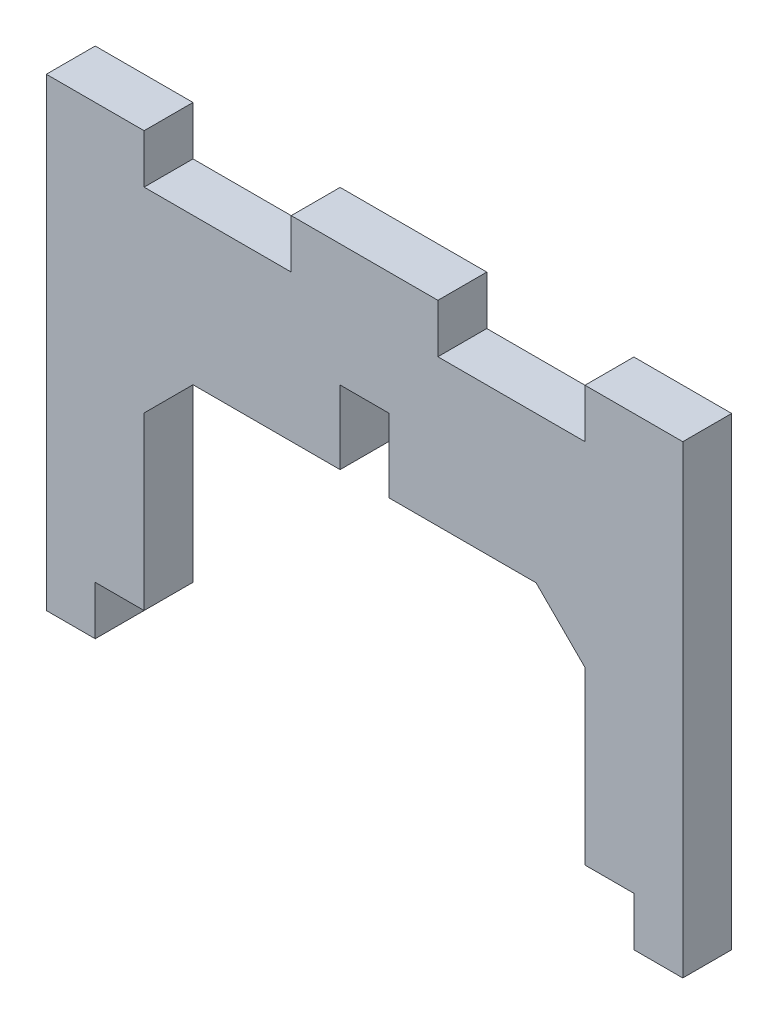
ISO-10303-21;
HEADER;
FILE_DESCRIPTION(('STEP AP214'),'2;1');
FILE_NAME('part.step','',(''),(''),'','','');
FILE_SCHEMA(('AUTOMOTIVE_DESIGN { 1 0 10303 214 1 1 1 1 }'));
ENDSEC;
DATA;
#1=APPLICATION_CONTEXT('core data for automotive mechanical design processes');
#2=APPLICATION_PROTOCOL_DEFINITION('international standard','automotive_design',2000,#1);
#3=PRODUCT_CONTEXT('',#1,'mechanical');
#4=PRODUCT('Part','Part','',(#3));
#5=PRODUCT_RELATED_PRODUCT_CATEGORY('part','',(#4));
#6=PRODUCT_DEFINITION_FORMATION('','',#4);
#7=PRODUCT_DEFINITION_CONTEXT('part definition',#1,'design');
#8=PRODUCT_DEFINITION('design','',#6,#7);
#9=PRODUCT_DEFINITION_SHAPE('','',#8);
#10=(LENGTH_UNIT() NAMED_UNIT(*) SI_UNIT(.MILLI.,.METRE.));
#11=(NAMED_UNIT(*) PLANE_ANGLE_UNIT() SI_UNIT($,.RADIAN.));
#12=(NAMED_UNIT(*) SI_UNIT($,.STERADIAN.) SOLID_ANGLE_UNIT());
#13=UNCERTAINTY_MEASURE_WITH_UNIT(LENGTH_MEASURE(1.E-05),#10,'distance_accuracy_value','');
#14=(GEOMETRIC_REPRESENTATION_CONTEXT(3) GLOBAL_UNCERTAINTY_ASSIGNED_CONTEXT((#13)) GLOBAL_UNIT_ASSIGNED_CONTEXT((#10,
#11,#12)) REPRESENTATION_CONTEXT('',''));
#15=CARTESIAN_POINT('',(0.,0.,0.));
#16=DIRECTION('',(0.,0.,1.));
#17=DIRECTION('',(1.,0.,0.));
#18=AXIS2_PLACEMENT_3D('',#15,#16,#17);
#19=CARTESIAN_POINT('',(0.,34.,4.));
#20=DIRECTION('',(0.,-1.,0.));
#21=DIRECTION('',(1.,0.,0.));
#22=AXIS2_PLACEMENT_3D('',#19,#20,#21);
#23=PLANE('',#22);
#24=DIRECTION('',(-1.,0.,0.));
#25=VECTOR('',#24,1.);
#26=CARTESIAN_POINT('',(0.,34.,0.));
#27=LINE('',#26,#25);
#28=CARTESIAN_POINT('',(44.07,34.,0.));
#29=VERTEX_POINT('',#28);
#30=CARTESIAN_POINT('',(32.035,34.,0.));
#31=VERTEX_POINT('',#30);
#32=EDGE_CURVE('E327',#29,#31,#27,.T.);
#33=ORIENTED_EDGE('',*,*,#32,.T.);
#34=DIRECTION('',(0.,0.,1.));
#35=VECTOR('',#34,1.);
#36=CARTESIAN_POINT('',(32.035,34.,-12.6491106406735));
#37=LINE('',#36,#35);
#38=CARTESIAN_POINT('',(32.035,34.,4.));
#39=VERTEX_POINT('',#38);
#40=EDGE_CURVE('E65',#31,#39,#37,.T.);
#41=ORIENTED_EDGE('',*,*,#40,.T.);
#42=DIRECTION('',(-1.,0.,0.));
#43=VECTOR('',#42,1.);
#44=CARTESIAN_POINT('',(0.,34.,4.));
#45=LINE('',#44,#43);
#46=CARTESIAN_POINT('',(44.07,34.,4.));
#47=VERTEX_POINT('',#46);
#48=EDGE_CURVE('E238',#47,#39,#45,.T.);
#49=ORIENTED_EDGE('',*,*,#48,.F.);
#50=DIRECTION('',(0.,0.,1.));
#51=VECTOR('',#50,1.);
#52=CARTESIAN_POINT('',(44.07,34.,-12.6491106406735));
#53=LINE('',#52,#51);
#54=EDGE_CURVE('E255',#29,#47,#53,.T.);
#55=ORIENTED_EDGE('',*,*,#54,.F.);
#56=EDGE_LOOP('',(#33,#41,#49,#55));
#57=FACE_BOUND('',#56,.T.);
#58=ADVANCED_FACE('F41',(#57),#23,.F.);
#59=CARTESIAN_POINT('',(20.035,34.,4.));
#60=VERTEX_POINT('',#59);
#61=CARTESIAN_POINT('',(8.,34.,4.));
#62=VERTEX_POINT('',#61);
#63=EDGE_CURVE('E57',#60,#62,#45,.T.);
#64=ORIENTED_EDGE('',*,*,#63,.F.);
#65=DIRECTION('',(0.,0.,1.));
#66=VECTOR('',#65,1.);
#67=CARTESIAN_POINT('',(20.035,34.,-12.6491106406735));
#68=LINE('',#67,#66);
#69=CARTESIAN_POINT('',(20.035,34.,0.));
#70=VERTEX_POINT('',#69);
#71=EDGE_CURVE('E246',#70,#60,#68,.T.);
#72=ORIENTED_EDGE('',*,*,#71,.F.);
#73=CARTESIAN_POINT('',(8.,34.,0.));
#74=VERTEX_POINT('',#73);
#75=EDGE_CURVE('E287',#70,#74,#27,.T.);
#76=ORIENTED_EDGE('',*,*,#75,.T.);
#77=DIRECTION('',(0.,0.,1.));
#78=VECTOR('',#77,1.);
#79=CARTESIAN_POINT('',(8.,34.,-12.6491106406735));
#80=LINE('',#79,#78);
#81=EDGE_CURVE('E279',#74,#62,#80,.T.);
#82=ORIENTED_EDGE('',*,*,#81,.T.);
#83=EDGE_LOOP('',(#64,#72,#76,#82));
#84=FACE_BOUND('',#83,.T.);
#85=ADVANCED_FACE('F490',(#84),#23,.F.);
#86=CARTESIAN_POINT('',(0.,0.,4.));
#87=DIRECTION('',(1.,0.,0.));
#88=DIRECTION('',(0.,1.,0.));
#89=AXIS2_PLACEMENT_3D('',#86,#87,#88);
#90=PLANE('',#89);
#91=DIRECTION('',(0.,-1.,0.));
#92=VECTOR('',#91,1.);
#93=CARTESIAN_POINT('',(0.,0.,0.));
#94=LINE('',#93,#92);
#95=CARTESIAN_POINT('',(0.,38.,0.));
#96=VERTEX_POINT('',#95);
#97=CARTESIAN_POINT('',(0.,0.,0.));
#98=VERTEX_POINT('',#97);
#99=EDGE_CURVE('E329',#96,#98,#94,.T.);
#100=ORIENTED_EDGE('',*,*,#99,.T.);
#101=DIRECTION('',(0.,0.,-1.));
#102=VECTOR('',#101,1.);
#103=CARTESIAN_POINT('',(0.,0.,4.));
#104=LINE('',#103,#102);
#105=CARTESIAN_POINT('',(0.,0.,4.));
#106=VERTEX_POINT('',#105);
#107=EDGE_CURVE('E394',#106,#98,#104,.T.);
#108=ORIENTED_EDGE('',*,*,#107,.F.);
#109=DIRECTION('',(0.,-1.,0.));
#110=VECTOR('',#109,1.);
#111=CARTESIAN_POINT('',(0.,0.,4.));
#112=LINE('',#111,#110);
#113=CARTESIAN_POINT('',(0.,38.,4.));
#114=VERTEX_POINT('',#113);
#115=EDGE_CURVE('E289',#114,#106,#112,.T.);
#116=ORIENTED_EDGE('',*,*,#115,.F.);
#117=DIRECTION('',(0.,0.,1.));
#118=VECTOR('',#117,1.);
#119=CARTESIAN_POINT('',(0.,38.,-12.6491106406735));
#120=LINE('',#119,#118);
#121=EDGE_CURVE('E273',#96,#114,#120,.T.);
#122=ORIENTED_EDGE('',*,*,#121,.F.);
#123=EDGE_LOOP('',(#100,#108,#116,#122));
#124=FACE_BOUND('',#123,.T.);
#125=ADVANCED_FACE('F500',(#124),#90,.F.);
#126=CARTESIAN_POINT('',(0.,0.,4.));
#127=DIRECTION('',(0.,1.,0.));
#128=DIRECTION('',(0.,0.,1.));
#129=AXIS2_PLACEMENT_3D('',#126,#127,#128);
#130=PLANE('',#129);
#131=DIRECTION('',(1.,0.,0.));
#132=VECTOR('',#131,1.);
#133=CARTESIAN_POINT('',(0.,0.,0.));
#134=LINE('',#133,#132);
#135=CARTESIAN_POINT('',(4.,0.,0.));
#136=VERTEX_POINT('',#135);
#137=EDGE_CURVE('E331',#98,#136,#134,.T.);
#138=ORIENTED_EDGE('',*,*,#137,.T.);
#139=DIRECTION('',(0.,0.,-1.));
#140=VECTOR('',#139,1.);
#141=CARTESIAN_POINT('',(4.,0.,4.));
#142=LINE('',#141,#140);
#143=CARTESIAN_POINT('',(4.,0.,4.));
#144=VERTEX_POINT('',#143);
#145=EDGE_CURVE('E391',#144,#136,#142,.T.);
#146=ORIENTED_EDGE('',*,*,#145,.F.);
#147=DIRECTION('',(1.,0.,0.));
#148=VECTOR('',#147,1.);
#149=CARTESIAN_POINT('',(0.,0.,4.));
#150=LINE('',#149,#148);
#151=EDGE_CURVE('E291',#106,#144,#150,.T.);
#152=ORIENTED_EDGE('',*,*,#151,.F.);
#153=ORIENTED_EDGE('',*,*,#107,.T.);
#154=EDGE_LOOP('',(#138,#146,#152,#153));
#155=FACE_BOUND('',#154,.T.);
#156=ADVANCED_FACE('F502',(#155),#130,.F.);
#157=CARTESIAN_POINT('',(4.,0.,4.));
#158=DIRECTION('',(-1.,0.,0.));
#159=DIRECTION('',(0.,0.,1.));
#160=AXIS2_PLACEMENT_3D('',#157,#158,#159);
#161=PLANE('',#160);
#162=DIRECTION('',(0.,1.,0.));
#163=VECTOR('',#162,1.);
#164=CARTESIAN_POINT('',(4.,0.,0.));
#165=LINE('',#164,#163);
#166=CARTESIAN_POINT('',(4.,4.,0.));
#167=VERTEX_POINT('',#166);
#168=EDGE_CURVE('E333',#136,#167,#165,.T.);
#169=ORIENTED_EDGE('',*,*,#168,.T.);
#170=DIRECTION('',(0.,0.,-1.));
#171=VECTOR('',#170,1.);
#172=CARTESIAN_POINT('',(4.,4.,4.));
#173=LINE('',#172,#171);
#174=CARTESIAN_POINT('',(4.,4.,4.));
#175=VERTEX_POINT('',#174);
#176=EDGE_CURVE('E388',#175,#167,#173,.T.);
#177=ORIENTED_EDGE('',*,*,#176,.F.);
#178=DIRECTION('',(0.,1.,0.));
#179=VECTOR('',#178,1.);
#180=CARTESIAN_POINT('',(4.,0.,4.));
#181=LINE('',#180,#179);
#182=EDGE_CURVE('E293',#144,#175,#181,.T.);
#183=ORIENTED_EDGE('',*,*,#182,.F.);
#184=ORIENTED_EDGE('',*,*,#145,.T.);
#185=EDGE_LOOP('',(#169,#177,#183,#184));
#186=FACE_BOUND('',#185,.T.);
#187=ADVANCED_FACE('F507',(#186),#161,.F.);
#188=CARTESIAN_POINT('',(0.,4.,4.));
#189=DIRECTION('',(0.,1.,0.));
#190=DIRECTION('',(0.,0.,1.));
#191=AXIS2_PLACEMENT_3D('',#188,#189,#190);
#192=PLANE('',#191);
#193=DIRECTION('',(1.,0.,0.));
#194=VECTOR('',#193,1.);
#195=CARTESIAN_POINT('',(0.,4.,0.));
#196=LINE('',#195,#194);
#197=CARTESIAN_POINT('',(8.,4.,0.));
#198=VERTEX_POINT('',#197);
#199=EDGE_CURVE('E335',#167,#198,#196,.T.);
#200=ORIENTED_EDGE('',*,*,#199,.T.);
#201=DIRECTION('',(0.,0.,-1.));
#202=VECTOR('',#201,1.);
#203=CARTESIAN_POINT('',(8.,4.,4.));
#204=LINE('',#203,#202);
#205=CARTESIAN_POINT('',(8.,4.,4.));
#206=VERTEX_POINT('',#205);
#207=EDGE_CURVE('E385',#206,#198,#204,.T.);
#208=ORIENTED_EDGE('',*,*,#207,.F.);
#209=DIRECTION('',(1.,0.,0.));
#210=VECTOR('',#209,1.);
#211=CARTESIAN_POINT('',(0.,4.,4.));
#212=LINE('',#211,#210);
#213=EDGE_CURVE('E295',#175,#206,#212,.T.);
#214=ORIENTED_EDGE('',*,*,#213,.F.);
#215=ORIENTED_EDGE('',*,*,#176,.T.);
#216=EDGE_LOOP('',(#200,#208,#214,#215));
#217=FACE_BOUND('',#216,.T.);
#218=ADVANCED_FACE('F510',(#217),#192,.F.);
#219=CARTESIAN_POINT('',(8.,0.,4.));
#220=DIRECTION('',(-1.,0.,0.));
#221=DIRECTION('',(0.,0.,1.));
#222=AXIS2_PLACEMENT_3D('',#219,#220,#221);
#223=PLANE('',#222);
#224=DIRECTION('',(0.,1.,0.));
#225=VECTOR('',#224,1.);
#226=CARTESIAN_POINT('',(8.,0.,0.));
#227=LINE('',#226,#225);
#228=CARTESIAN_POINT('',(8.,18.,0.));
#229=VERTEX_POINT('',#228);
#230=EDGE_CURVE('E337',#198,#229,#227,.T.);
#231=ORIENTED_EDGE('',*,*,#230,.T.);
#232=DIRECTION('',(0.,0.,1.));
#233=VECTOR('',#232,1.);
#234=CARTESIAN_POINT('',(8.,18.,4.));
#235=LINE('',#234,#233);
#236=CARTESIAN_POINT('',(8.,18.,4.));
#237=VERTEX_POINT('',#236);
#238=EDGE_CURVE('E405',#229,#237,#235,.T.);
#239=ORIENTED_EDGE('',*,*,#238,.T.);
#240=DIRECTION('',(0.,1.,0.));
#241=VECTOR('',#240,1.);
#242=CARTESIAN_POINT('',(8.,0.,4.));
#243=LINE('',#242,#241);
#244=EDGE_CURVE('E297',#206,#237,#243,.T.);
#245=ORIENTED_EDGE('',*,*,#244,.F.);
#246=ORIENTED_EDGE('',*,*,#207,.T.);
#247=EDGE_LOOP('',(#231,#239,#245,#246));
#248=FACE_BOUND('',#247,.T.);
#249=ADVANCED_FACE('F420',(#248),#223,.F.);
#250=CARTESIAN_POINT('',(0.,22.,4.));
#251=DIRECTION('',(0.,1.,0.));
#252=DIRECTION('',(0.,0.,1.));
#253=AXIS2_PLACEMENT_3D('',#250,#251,#252);
#254=PLANE('',#253);
#255=DIRECTION('',(1.,0.,0.));
#256=VECTOR('',#255,1.);
#257=CARTESIAN_POINT('',(0.,22.,4.));
#258=LINE('',#257,#256);
#259=CARTESIAN_POINT('',(12.,22.,4.));
#260=VERTEX_POINT('',#259);
#261=CARTESIAN_POINT('',(24.035,22.,4.));
#262=VERTEX_POINT('',#261);
#263=EDGE_CURVE('E300',#260,#262,#258,.T.);
#264=ORIENTED_EDGE('',*,*,#263,.F.);
#265=DIRECTION('',(0.,0.,-1.));
#266=VECTOR('',#265,1.);
#267=CARTESIAN_POINT('',(12.,22.,0.));
#268=LINE('',#267,#266);
#269=CARTESIAN_POINT('',(12.,22.,0.));
#270=VERTEX_POINT('',#269);
#271=EDGE_CURVE('E402',#260,#270,#268,.T.);
#272=ORIENTED_EDGE('',*,*,#271,.T.);
#273=DIRECTION('',(1.,0.,0.));
#274=VECTOR('',#273,1.);
#275=CARTESIAN_POINT('',(0.,22.,0.));
#276=LINE('',#275,#274);
#277=CARTESIAN_POINT('',(24.035,22.,0.));
#278=VERTEX_POINT('',#277);
#279=EDGE_CURVE('E340',#270,#278,#276,.T.);
#280=ORIENTED_EDGE('',*,*,#279,.T.);
#281=DIRECTION('',(0.,0.,-1.));
#282=VECTOR('',#281,1.);
#283=CARTESIAN_POINT('',(24.035,22.,4.));
#284=LINE('',#283,#282);
#285=EDGE_CURVE('E382',#262,#278,#284,.T.);
#286=ORIENTED_EDGE('',*,*,#285,.F.);
#287=EDGE_LOOP('',(#264,#272,#280,#286));
#288=FACE_BOUND('',#287,.T.);
#289=ADVANCED_FACE('F427',(#288),#254,.F.);
#290=CARTESIAN_POINT('',(24.035,0.,4.));
#291=DIRECTION('',(-1.,0.,0.));
#292=DIRECTION('',(0.,-1.,0.));
#293=AXIS2_PLACEMENT_3D('',#290,#291,#292);
#294=PLANE('',#293);
#295=DIRECTION('',(0.,1.,0.));
#296=VECTOR('',#295,1.);
#297=CARTESIAN_POINT('',(24.035,0.,0.));
#298=LINE('',#297,#296);
#299=CARTESIAN_POINT('',(24.035,28.,0.));
#300=VERTEX_POINT('',#299);
#301=EDGE_CURVE('E342',#278,#300,#298,.T.);
#302=ORIENTED_EDGE('',*,*,#301,.T.);
#303=DIRECTION('',(0.,0.,-1.));
#304=VECTOR('',#303,1.);
#305=CARTESIAN_POINT('',(24.035,28.,4.));
#306=LINE('',#305,#304);
#307=CARTESIAN_POINT('',(24.035,28.,4.));
#308=VERTEX_POINT('',#307);
#309=EDGE_CURVE('E379',#308,#300,#306,.T.);
#310=ORIENTED_EDGE('',*,*,#309,.F.);
#311=DIRECTION('',(0.,1.,0.));
#312=VECTOR('',#311,1.);
#313=CARTESIAN_POINT('',(24.035,0.,4.));
#314=LINE('',#313,#312);
#315=EDGE_CURVE('E302',#262,#308,#314,.T.);
#316=ORIENTED_EDGE('',*,*,#315,.F.);
#317=ORIENTED_EDGE('',*,*,#285,.T.);
#318=EDGE_LOOP('',(#302,#310,#316,#317));
#319=FACE_BOUND('',#318,.T.);
#320=ADVANCED_FACE('F431',(#319),#294,.F.);
#321=CARTESIAN_POINT('',(0.,28.,4.));
#322=DIRECTION('',(0.,1.,0.));
#323=DIRECTION('',(0.,0.,1.));
#324=AXIS2_PLACEMENT_3D('',#321,#322,#323);
#325=PLANE('',#324);
#326=DIRECTION('',(1.,0.,0.));
#327=VECTOR('',#326,1.);
#328=CARTESIAN_POINT('',(0.,28.,0.));
#329=LINE('',#328,#327);
#330=CARTESIAN_POINT('',(28.035,28.,0.));
#331=VERTEX_POINT('',#330);
#332=EDGE_CURVE('E344',#300,#331,#329,.T.);
#333=ORIENTED_EDGE('',*,*,#332,.T.);
#334=DIRECTION('',(0.,0.,-1.));
#335=VECTOR('',#334,1.);
#336=CARTESIAN_POINT('',(28.035,28.,4.));
#337=LINE('',#336,#335);
#338=CARTESIAN_POINT('',(28.035,28.,4.));
#339=VERTEX_POINT('',#338);
#340=EDGE_CURVE('E377',#339,#331,#337,.T.);
#341=ORIENTED_EDGE('',*,*,#340,.F.);
#342=DIRECTION('',(1.,0.,0.));
#343=VECTOR('',#342,1.);
#344=CARTESIAN_POINT('',(0.,28.,4.));
#345=LINE('',#344,#343);
#346=EDGE_CURVE('E304',#308,#339,#345,.T.);
#347=ORIENTED_EDGE('',*,*,#346,.F.);
#348=ORIENTED_EDGE('',*,*,#309,.T.);
#349=EDGE_LOOP('',(#333,#341,#347,#348));
#350=FACE_BOUND('',#349,.T.);
#351=ADVANCED_FACE('F437',(#350),#325,.F.);
#352=CARTESIAN_POINT('',(28.035,0.,4.));
#353=DIRECTION('',(-1.,0.,0.));
#354=DIRECTION('',(0.,-1.,0.));
#355=AXIS2_PLACEMENT_3D('',#352,#353,#354);
#356=PLANE('',#355);
#357=DIRECTION('',(0.,1.,0.));
#358=VECTOR('',#357,1.);
#359=CARTESIAN_POINT('',(28.035,0.,0.));
#360=LINE('',#359,#358);
#361=CARTESIAN_POINT('',(28.035,22.,0.));
#362=VERTEX_POINT('',#361);
#363=EDGE_CURVE('E347',#362,#331,#360,.T.);
#364=ORIENTED_EDGE('',*,*,#363,.F.);
#365=DIRECTION('',(0.,0.,-1.));
#366=VECTOR('',#365,1.);
#367=CARTESIAN_POINT('',(28.035,22.,4.));
#368=LINE('',#367,#366);
#369=CARTESIAN_POINT('',(28.035,22.,4.));
#370=VERTEX_POINT('',#369);
#371=EDGE_CURVE('E374',#370,#362,#368,.T.);
#372=ORIENTED_EDGE('',*,*,#371,.F.);
#373=DIRECTION('',(0.,1.,0.));
#374=VECTOR('',#373,1.);
#375=CARTESIAN_POINT('',(28.035,0.,4.));
#376=LINE('',#375,#374);
#377=EDGE_CURVE('E306',#370,#339,#376,.T.);
#378=ORIENTED_EDGE('',*,*,#377,.T.);
#379=ORIENTED_EDGE('',*,*,#340,.T.);
#380=EDGE_LOOP('',(#364,#372,#378,#379));
#381=FACE_BOUND('',#380,.T.);
#382=ADVANCED_FACE('F442',(#381),#356,.T.);
#383=CARTESIAN_POINT('',(0.,22.,4.));
#384=DIRECTION('',(0.,-1.,0.));
#385=DIRECTION('',(0.,0.,-1.));
#386=AXIS2_PLACEMENT_3D('',#383,#384,#385);
#387=PLANE('',#386);
#388=DIRECTION('',(-1.,0.,0.));
#389=VECTOR('',#388,1.);
#390=CARTESIAN_POINT('',(0.,22.,0.));
#391=LINE('',#390,#389);
#392=CARTESIAN_POINT('',(40.07,22.,0.));
#393=VERTEX_POINT('',#392);
#394=EDGE_CURVE('E350',#393,#362,#391,.T.);
#395=ORIENTED_EDGE('',*,*,#394,.F.);
#396=DIRECTION('',(0.,0.,1.));
#397=VECTOR('',#396,1.);
#398=CARTESIAN_POINT('',(40.07,22.,4.));
#399=LINE('',#398,#397);
#400=CARTESIAN_POINT('',(40.07,22.,4.));
#401=VERTEX_POINT('',#400);
#402=EDGE_CURVE('E400',#393,#401,#399,.T.);
#403=ORIENTED_EDGE('',*,*,#402,.T.);
#404=DIRECTION('',(-1.,0.,0.));
#405=VECTOR('',#404,1.);
#406=CARTESIAN_POINT('',(0.,22.,4.));
#407=LINE('',#406,#405);
#408=EDGE_CURVE('E309',#401,#370,#407,.T.);
#409=ORIENTED_EDGE('',*,*,#408,.T.);
#410=ORIENTED_EDGE('',*,*,#371,.T.);
#411=EDGE_LOOP('',(#395,#403,#409,#410));
#412=FACE_BOUND('',#411,.T.);
#413=ADVANCED_FACE('F445',(#412),#387,.T.);
#414=CARTESIAN_POINT('',(44.07,0.,4.));
#415=DIRECTION('',(-1.,0.,0.));
#416=DIRECTION('',(0.,0.,1.));
#417=AXIS2_PLACEMENT_3D('',#414,#415,#416);
#418=PLANE('',#417);
#419=DIRECTION('',(0.,1.,0.));
#420=VECTOR('',#419,1.);
#421=CARTESIAN_POINT('',(44.07,0.,4.));
#422=LINE('',#421,#420);
#423=CARTESIAN_POINT('',(44.07,4.,4.));
#424=VERTEX_POINT('',#423);
#425=CARTESIAN_POINT('',(44.07,18.,4.));
#426=VERTEX_POINT('',#425);
#427=EDGE_CURVE('E311',#424,#426,#422,.T.);
#428=ORIENTED_EDGE('',*,*,#427,.T.);
#429=DIRECTION('',(0.,0.,-1.));
#430=VECTOR('',#429,1.);
#431=CARTESIAN_POINT('',(44.07,18.,0.));
#432=LINE('',#431,#430);
#433=CARTESIAN_POINT('',(44.07,18.,0.));
#434=VERTEX_POINT('',#433);
#435=EDGE_CURVE('E397',#426,#434,#432,.T.);
#436=ORIENTED_EDGE('',*,*,#435,.T.);
#437=DIRECTION('',(0.,1.,0.));
#438=VECTOR('',#437,1.);
#439=CARTESIAN_POINT('',(44.07,0.,0.));
#440=LINE('',#439,#438);
#441=CARTESIAN_POINT('',(44.07,4.,0.));
#442=VERTEX_POINT('',#441);
#443=EDGE_CURVE('E352',#442,#434,#440,.T.);
#444=ORIENTED_EDGE('',*,*,#443,.F.);
#445=DIRECTION('',(0.,0.,-1.));
#446=VECTOR('',#445,1.);
#447=CARTESIAN_POINT('',(44.07,4.,4.));
#448=LINE('',#447,#446);
#449=EDGE_CURVE('E372',#424,#442,#448,.T.);
#450=ORIENTED_EDGE('',*,*,#449,.F.);
#451=EDGE_LOOP('',(#428,#436,#444,#450));
#452=FACE_BOUND('',#451,.T.);
#453=ADVANCED_FACE('F454',(#452),#418,.T.);
#454=CARTESIAN_POINT('',(0.,4.,4.));
#455=DIRECTION('',(0.,-1.,0.));
#456=DIRECTION('',(0.,0.,-1.));
#457=AXIS2_PLACEMENT_3D('',#454,#455,#456);
#458=PLANE('',#457);
#459=DIRECTION('',(-1.,0.,0.));
#460=VECTOR('',#459,1.);
#461=CARTESIAN_POINT('',(0.,4.,0.));
#462=LINE('',#461,#460);
#463=CARTESIAN_POINT('',(48.07,4.,0.));
#464=VERTEX_POINT('',#463);
#465=EDGE_CURVE('E355',#464,#442,#462,.T.);
#466=ORIENTED_EDGE('',*,*,#465,.F.);
#467=DIRECTION('',(0.,0.,-1.));
#468=VECTOR('',#467,1.);
#469=CARTESIAN_POINT('',(48.07,4.,4.));
#470=LINE('',#469,#468);
#471=CARTESIAN_POINT('',(48.07,4.,4.));
#472=VERTEX_POINT('',#471);
#473=EDGE_CURVE('E370',#472,#464,#470,.T.);
#474=ORIENTED_EDGE('',*,*,#473,.F.);
#475=DIRECTION('',(-1.,0.,0.));
#476=VECTOR('',#475,1.);
#477=CARTESIAN_POINT('',(0.,4.,4.));
#478=LINE('',#477,#476);
#479=EDGE_CURVE('E314',#472,#424,#478,.T.);
#480=ORIENTED_EDGE('',*,*,#479,.T.);
#481=ORIENTED_EDGE('',*,*,#449,.T.);
#482=EDGE_LOOP('',(#466,#474,#480,#481));
#483=FACE_BOUND('',#482,.T.);
#484=ADVANCED_FACE('F458',(#483),#458,.T.);
#485=CARTESIAN_POINT('',(48.07,0.,4.));
#486=DIRECTION('',(-1.,0.,0.));
#487=DIRECTION('',(0.,0.,1.));
#488=AXIS2_PLACEMENT_3D('',#485,#486,#487);
#489=PLANE('',#488);
#490=DIRECTION('',(0.,1.,0.));
#491=VECTOR('',#490,1.);
#492=CARTESIAN_POINT('',(48.07,0.,0.));
#493=LINE('',#492,#491);
#494=CARTESIAN_POINT('',(48.07,0.,0.));
#495=VERTEX_POINT('',#494);
#496=EDGE_CURVE('E358',#495,#464,#493,.T.);
#497=ORIENTED_EDGE('',*,*,#496,.F.);
#498=DIRECTION('',(0.,0.,-1.));
#499=VECTOR('',#498,1.);
#500=CARTESIAN_POINT('',(48.07,0.,4.));
#501=LINE('',#500,#499);
#502=CARTESIAN_POINT('',(48.07,0.,4.));
#503=VERTEX_POINT('',#502);
#504=EDGE_CURVE('E368',#503,#495,#501,.T.);
#505=ORIENTED_EDGE('',*,*,#504,.F.);
#506=DIRECTION('',(0.,1.,0.));
#507=VECTOR('',#506,1.);
#508=CARTESIAN_POINT('',(48.07,0.,4.));
#509=LINE('',#508,#507);
#510=EDGE_CURVE('E317',#503,#472,#509,.T.);
#511=ORIENTED_EDGE('',*,*,#510,.T.);
#512=ORIENTED_EDGE('',*,*,#473,.T.);
#513=EDGE_LOOP('',(#497,#505,#511,#512));
#514=FACE_BOUND('',#513,.T.);
#515=ADVANCED_FACE('F463',(#514),#489,.T.);
#516=CARTESIAN_POINT('',(0.,0.,4.));
#517=DIRECTION('',(0.,-1.,0.));
#518=DIRECTION('',(0.,0.,-1.));
#519=AXIS2_PLACEMENT_3D('',#516,#517,#518);
#520=PLANE('',#519);
#521=DIRECTION('',(-1.,0.,0.));
#522=VECTOR('',#521,1.);
#523=CARTESIAN_POINT('',(0.,0.,0.));
#524=LINE('',#523,#522);
#525=CARTESIAN_POINT('',(52.07,0.,0.));
#526=VERTEX_POINT('',#525);
#527=EDGE_CURVE('E361',#526,#495,#524,.T.);
#528=ORIENTED_EDGE('',*,*,#527,.F.);
#529=DIRECTION('',(0.,0.,-1.));
#530=VECTOR('',#529,1.);
#531=CARTESIAN_POINT('',(52.07,0.,4.));
#532=LINE('',#531,#530);
#533=CARTESIAN_POINT('',(52.07,0.,4.));
#534=VERTEX_POINT('',#533);
#535=EDGE_CURVE('E326',#534,#526,#532,.T.);
#536=ORIENTED_EDGE('',*,*,#535,.F.);
#537=DIRECTION('',(-1.,0.,0.));
#538=VECTOR('',#537,1.);
#539=CARTESIAN_POINT('',(0.,0.,4.));
#540=LINE('',#539,#538);
#541=EDGE_CURVE('E320',#534,#503,#540,.T.);
#542=ORIENTED_EDGE('',*,*,#541,.T.);
#543=ORIENTED_EDGE('',*,*,#504,.T.);
#544=EDGE_LOOP('',(#528,#536,#542,#543));
#545=FACE_BOUND('',#544,.T.);
#546=ADVANCED_FACE('F466',(#545),#520,.T.);
#547=CARTESIAN_POINT('',(52.07,0.,4.));
#548=DIRECTION('',(1.,0.,0.));
#549=DIRECTION('',(0.,0.,-1.));
#550=AXIS2_PLACEMENT_3D('',#547,#548,#549);
#551=PLANE('',#550);
#552=DIRECTION('',(0.,-1.,0.));
#553=VECTOR('',#552,1.);
#554=CARTESIAN_POINT('',(52.07,0.,0.));
#555=LINE('',#554,#553);
#556=CARTESIAN_POINT('',(52.07,38.,0.));
#557=VERTEX_POINT('',#556);
#558=EDGE_CURVE('E364',#557,#526,#555,.T.);
#559=ORIENTED_EDGE('',*,*,#558,.F.);
#560=DIRECTION('',(0.,0.,1.));
#561=VECTOR('',#560,1.);
#562=CARTESIAN_POINT('',(52.07,38.,-12.6491106406735));
#563=LINE('',#562,#561);
#564=CARTESIAN_POINT('',(52.07,38.,4.));
#565=VERTEX_POINT('',#564);
#566=EDGE_CURVE('E260',#557,#565,#563,.T.);
#567=ORIENTED_EDGE('',*,*,#566,.T.);
#568=DIRECTION('',(0.,-1.,0.));
#569=VECTOR('',#568,1.);
#570=CARTESIAN_POINT('',(52.07,0.,4.));
#571=LINE('',#570,#569);
#572=EDGE_CURVE('E323',#565,#534,#571,.T.);
#573=ORIENTED_EDGE('',*,*,#572,.T.);
#574=ORIENTED_EDGE('',*,*,#535,.T.);
#575=EDGE_LOOP('',(#559,#567,#573,#574));
#576=FACE_BOUND('',#575,.T.);
#577=ADVANCED_FACE('F468',(#576),#551,.T.);
#578=CARTESIAN_POINT('',(0.,0.,4.));
#579=DIRECTION('',(0.,0.,1.));
#580=DIRECTION('',(1.,0.,0.));
#581=AXIS2_PLACEMENT_3D('',#578,#579,#580);
#582=PLANE('',#581);
#583=ORIENTED_EDGE('',*,*,#572,.F.);
#584=DIRECTION('',(-1.,0.,0.));
#585=VECTOR('',#584,1.);
#586=CARTESIAN_POINT('',(52.07,38.,4.));
#587=LINE('',#586,#585);
#588=CARTESIAN_POINT('',(44.07,38.,4.));
#589=VERTEX_POINT('',#588);
#590=EDGE_CURVE('E251',#565,#589,#587,.T.);
#591=ORIENTED_EDGE('',*,*,#590,.T.);
#592=DIRECTION('',(0.,-1.,0.));
#593=VECTOR('',#592,1.);
#594=CARTESIAN_POINT('',(44.07,34.,4.));
#595=LINE('',#594,#593);
#596=EDGE_CURVE('E258',#589,#47,#595,.T.);
#597=ORIENTED_EDGE('',*,*,#596,.T.);
#598=ORIENTED_EDGE('',*,*,#48,.T.);
#599=DIRECTION('',(0.,1.,0.));
#600=VECTOR('',#599,1.);
#601=CARTESIAN_POINT('',(32.035,34.,4.));
#602=LINE('',#601,#600);
#603=CARTESIAN_POINT('',(32.035,38.,4.));
#604=VERTEX_POINT('',#603);
#605=EDGE_CURVE('E220',#39,#604,#602,.T.);
#606=ORIENTED_EDGE('',*,*,#605,.T.);
#607=DIRECTION('',(-1.,0.,0.));
#608=VECTOR('',#607,1.);
#609=CARTESIAN_POINT('',(32.035,38.,4.));
#610=LINE('',#609,#608);
#611=CARTESIAN_POINT('',(20.035,38.,4.));
#612=VERTEX_POINT('',#611);
#613=EDGE_CURVE('E229',#604,#612,#610,.T.);
#614=ORIENTED_EDGE('',*,*,#613,.T.);
#615=DIRECTION('',(0.,-1.,0.));
#616=VECTOR('',#615,1.);
#617=CARTESIAN_POINT('',(20.035,34.,4.));
#618=LINE('',#617,#616);
#619=EDGE_CURVE('E226',#612,#60,#618,.T.);
#620=ORIENTED_EDGE('',*,*,#619,.T.);
#621=ORIENTED_EDGE('',*,*,#63,.T.);
#622=DIRECTION('',(0.,1.,0.));
#623=VECTOR('',#622,1.);
#624=CARTESIAN_POINT('',(8.,38.,4.));
#625=LINE('',#624,#623);
#626=CARTESIAN_POINT('',(8.,38.,4.));
#627=VERTEX_POINT('',#626);
#628=EDGE_CURVE('E269',#62,#627,#625,.T.);
#629=ORIENTED_EDGE('',*,*,#628,.T.);
#630=DIRECTION('',(-1.,0.,0.));
#631=VECTOR('',#630,1.);
#632=CARTESIAN_POINT('',(0.,38.,4.));
#633=LINE('',#632,#631);
#634=EDGE_CURVE('E276',#627,#114,#633,.T.);
#635=ORIENTED_EDGE('',*,*,#634,.T.);
#636=ORIENTED_EDGE('',*,*,#115,.T.);
#637=ORIENTED_EDGE('',*,*,#151,.T.);
#638=ORIENTED_EDGE('',*,*,#182,.T.);
#639=ORIENTED_EDGE('',*,*,#213,.T.);
#640=ORIENTED_EDGE('',*,*,#244,.T.);
#641=DIRECTION('',(-0.707106781186551,-0.707106781186544,0.));
#642=VECTOR('',#641,1.);
#643=CARTESIAN_POINT('',(12.,22.,4.));
#644=LINE('',#643,#642);
#645=EDGE_CURVE('E11',#237,#260,#644,.F.);
#646=ORIENTED_EDGE('',*,*,#645,.T.);
#647=ORIENTED_EDGE('',*,*,#263,.T.);
#648=ORIENTED_EDGE('',*,*,#315,.T.);
#649=ORIENTED_EDGE('',*,*,#346,.T.);
#650=ORIENTED_EDGE('',*,*,#377,.F.);
#651=ORIENTED_EDGE('',*,*,#408,.F.);
#652=DIRECTION('',(-0.707106781186544,0.707106781186551,0.));
#653=VECTOR('',#652,1.);
#654=CARTESIAN_POINT('',(44.07,18.,4.));
#655=LINE('',#654,#653);
#656=EDGE_CURVE('E409',#401,#426,#655,.F.);
#657=ORIENTED_EDGE('',*,*,#656,.T.);
#658=ORIENTED_EDGE('',*,*,#427,.F.);
#659=ORIENTED_EDGE('',*,*,#479,.F.);
#660=ORIENTED_EDGE('',*,*,#510,.F.);
#661=ORIENTED_EDGE('',*,*,#541,.F.);
#662=EDGE_LOOP('',(#583,#591,#597,#598,#606,#614,#620,#621,#629,#635,#636,#637,#638,#639,#640,
#646,#647,#648,#649,#650,#651,#657,#658,#659,#660,#661));
#663=FACE_BOUND('',#662,.T.);
#664=ADVANCED_FACE('F236',(#663),#582,.T.);
#665=CARTESIAN_POINT('',(0.,0.,0.));
#666=DIRECTION('',(0.,0.,1.));
#667=DIRECTION('',(1.,0.,0.));
#668=AXIS2_PLACEMENT_3D('',#665,#666,#667);
#669=PLANE('',#668);
#670=ORIENTED_EDGE('',*,*,#32,.F.);
#671=DIRECTION('',(0.,1.,0.));
#672=VECTOR('',#671,1.);
#673=CARTESIAN_POINT('',(44.07,34.,0.));
#674=LINE('',#673,#672);
#675=CARTESIAN_POINT('',(44.07,38.,0.));
#676=VERTEX_POINT('',#675);
#677=EDGE_CURVE('E252',#29,#676,#674,.T.);
#678=ORIENTED_EDGE('',*,*,#677,.T.);
#679=DIRECTION('',(1.,0.,0.));
#680=VECTOR('',#679,1.);
#681=CARTESIAN_POINT('',(52.07,38.,0.));
#682=LINE('',#681,#680);
#683=EDGE_CURVE('E254',#676,#557,#682,.T.);
#684=ORIENTED_EDGE('',*,*,#683,.T.);
#685=ORIENTED_EDGE('',*,*,#558,.T.);
#686=ORIENTED_EDGE('',*,*,#527,.T.);
#687=ORIENTED_EDGE('',*,*,#496,.T.);
#688=ORIENTED_EDGE('',*,*,#465,.T.);
#689=ORIENTED_EDGE('',*,*,#443,.T.);
#690=DIRECTION('',(0.707106781186544,-0.707106781186551,0.));
#691=VECTOR('',#690,1.);
#692=CARTESIAN_POINT('',(31.0350000000002,31.0349999999999,0.));
#693=LINE('',#692,#691);
#694=EDGE_CURVE('E407',#434,#393,#693,.F.);
#695=ORIENTED_EDGE('',*,*,#694,.T.);
#696=ORIENTED_EDGE('',*,*,#394,.T.);
#697=ORIENTED_EDGE('',*,*,#363,.T.);
#698=ORIENTED_EDGE('',*,*,#332,.F.);
#699=ORIENTED_EDGE('',*,*,#301,.F.);
#700=ORIENTED_EDGE('',*,*,#279,.F.);
#701=DIRECTION('',(0.707106781186551,0.707106781186544,0.));
#702=VECTOR('',#701,1.);
#703=CARTESIAN_POINT('',(-5.00000000000004,5.0000000000001,0.));
#704=LINE('',#703,#702);
#705=EDGE_CURVE('E50',#270,#229,#704,.F.);
#706=ORIENTED_EDGE('',*,*,#705,.T.);
#707=ORIENTED_EDGE('',*,*,#230,.F.);
#708=ORIENTED_EDGE('',*,*,#199,.F.);
#709=ORIENTED_EDGE('',*,*,#168,.F.);
#710=ORIENTED_EDGE('',*,*,#137,.F.);
#711=ORIENTED_EDGE('',*,*,#99,.F.);
#712=DIRECTION('',(1.,0.,0.));
#713=VECTOR('',#712,1.);
#714=CARTESIAN_POINT('',(0.,38.,0.));
#715=LINE('',#714,#713);
#716=CARTESIAN_POINT('',(8.,38.,0.));
#717=VERTEX_POINT('',#716);
#718=EDGE_CURVE('E270',#96,#717,#715,.T.);
#719=ORIENTED_EDGE('',*,*,#718,.T.);
#720=DIRECTION('',(0.,-1.,0.));
#721=VECTOR('',#720,1.);
#722=CARTESIAN_POINT('',(8.,38.,0.));
#723=LINE('',#722,#721);
#724=EDGE_CURVE('E272',#717,#74,#723,.T.);
#725=ORIENTED_EDGE('',*,*,#724,.T.);
#726=ORIENTED_EDGE('',*,*,#75,.F.);
#727=DIRECTION('',(0.,1.,0.));
#728=VECTOR('',#727,1.);
#729=CARTESIAN_POINT('',(20.035,34.,0.));
#730=LINE('',#729,#728);
#731=CARTESIAN_POINT('',(20.035,38.,0.));
#732=VERTEX_POINT('',#731);
#733=EDGE_CURVE('E245',#70,#732,#730,.T.);
#734=ORIENTED_EDGE('',*,*,#733,.T.);
#735=DIRECTION('',(1.,0.,0.));
#736=VECTOR('',#735,1.);
#737=CARTESIAN_POINT('',(32.035,38.,0.));
#738=LINE('',#737,#736);
#739=CARTESIAN_POINT('',(32.035,38.,0.));
#740=VERTEX_POINT('',#739);
#741=EDGE_CURVE('E249',#732,#740,#738,.T.);
#742=ORIENTED_EDGE('',*,*,#741,.T.);
#743=DIRECTION('',(0.,-1.,0.));
#744=VECTOR('',#743,1.);
#745=CARTESIAN_POINT('',(32.035,34.,0.));
#746=LINE('',#745,#744);
#747=EDGE_CURVE('E222',#740,#31,#746,.T.);
#748=ORIENTED_EDGE('',*,*,#747,.T.);
#749=EDGE_LOOP('',(#670,#678,#684,#685,#686,#687,#688,#689,#695,#696,#697,#698,#699,#700,#706,
#707,#708,#709,#710,#711,#719,#725,#726,#734,#742,#748));
#750=FACE_BOUND('',#749,.T.);
#751=ADVANCED_FACE('F413',(#750),#669,.F.);
#752=CARTESIAN_POINT('',(44.07,18.,4.));
#753=DIRECTION('',(-0.707106781186551,-0.707106781186544,0.));
#754=DIRECTION('',(0.,0.,1.));
#755=AXIS2_PLACEMENT_3D('',#752,#753,#754);
#756=PLANE('',#755);
#757=ORIENTED_EDGE('',*,*,#656,.F.);
#758=ORIENTED_EDGE('',*,*,#402,.F.);
#759=ORIENTED_EDGE('',*,*,#694,.F.);
#760=ORIENTED_EDGE('',*,*,#435,.F.);
#761=EDGE_LOOP('',(#757,#758,#759,#760));
#762=FACE_BOUND('',#761,.T.);
#763=ADVANCED_FACE('F451',(#762),#756,.T.);
#764=CARTESIAN_POINT('',(12.,22.,4.));
#765=DIRECTION('',(0.707106781186544,-0.707106781186551,0.));
#766=DIRECTION('',(0.,0.,1.));
#767=AXIS2_PLACEMENT_3D('',#764,#765,#766);
#768=PLANE('',#767);
#769=ORIENTED_EDGE('',*,*,#645,.F.);
#770=ORIENTED_EDGE('',*,*,#238,.F.);
#771=ORIENTED_EDGE('',*,*,#705,.F.);
#772=ORIENTED_EDGE('',*,*,#271,.F.);
#773=EDGE_LOOP('',(#769,#770,#771,#772));
#774=FACE_BOUND('',#773,.T.);
#775=ADVANCED_FACE('F44',(#774),#768,.T.);
#776=CARTESIAN_POINT('',(0.,38.,-12.6491106406735));
#777=DIRECTION('',(0.,1.,0.));
#778=DIRECTION('',(0.,0.,1.));
#779=AXIS2_PLACEMENT_3D('',#776,#777,#778);
#780=PLANE('',#779);
#781=ORIENTED_EDGE('',*,*,#718,.F.);
#782=ORIENTED_EDGE('',*,*,#121,.T.);
#783=ORIENTED_EDGE('',*,*,#634,.F.);
#784=DIRECTION('',(0.,0.,1.));
#785=VECTOR('',#784,1.);
#786=CARTESIAN_POINT('',(8.,38.,-12.6491106406735));
#787=LINE('',#786,#785);
#788=EDGE_CURVE('E282',#717,#627,#787,.T.);
#789=ORIENTED_EDGE('',*,*,#788,.F.);
#790=EDGE_LOOP('',(#781,#782,#783,#789));
#791=FACE_BOUND('',#790,.T.);
#792=ADVANCED_FACE('F495',(#791),#780,.T.);
#793=CARTESIAN_POINT('',(8.,38.,-12.6491106406735));
#794=DIRECTION('',(1.,0.,0.));
#795=DIRECTION('',(0.,0.,-1.));
#796=AXIS2_PLACEMENT_3D('',#793,#794,#795);
#797=PLANE('',#796);
#798=ORIENTED_EDGE('',*,*,#724,.F.);
#799=ORIENTED_EDGE('',*,*,#788,.T.);
#800=ORIENTED_EDGE('',*,*,#628,.F.);
#801=ORIENTED_EDGE('',*,*,#81,.F.);
#802=EDGE_LOOP('',(#798,#799,#800,#801));
#803=FACE_BOUND('',#802,.T.);
#804=ADVANCED_FACE('F487',(#803),#797,.T.);
#805=CARTESIAN_POINT('',(44.07,34.,-12.6491106406735));
#806=DIRECTION('',(-1.,0.,0.));
#807=DIRECTION('',(0.,0.,1.));
#808=AXIS2_PLACEMENT_3D('',#805,#806,#807);
#809=PLANE('',#808);
#810=ORIENTED_EDGE('',*,*,#677,.F.);
#811=ORIENTED_EDGE('',*,*,#54,.T.);
#812=ORIENTED_EDGE('',*,*,#596,.F.);
#813=DIRECTION('',(0.,0.,1.));
#814=VECTOR('',#813,1.);
#815=CARTESIAN_POINT('',(44.07,38.,-12.6491106406735));
#816=LINE('',#815,#814);
#817=EDGE_CURVE('E263',#676,#589,#816,.T.);
#818=ORIENTED_EDGE('',*,*,#817,.F.);
#819=EDGE_LOOP('',(#810,#811,#812,#818));
#820=FACE_BOUND('',#819,.T.);
#821=ADVANCED_FACE('F478',(#820),#809,.T.);
#822=CARTESIAN_POINT('',(52.07,38.,-12.6491106406735));
#823=DIRECTION('',(0.,1.,0.));
#824=DIRECTION('',(0.,0.,1.));
#825=AXIS2_PLACEMENT_3D('',#822,#823,#824);
#826=PLANE('',#825);
#827=ORIENTED_EDGE('',*,*,#683,.F.);
#828=ORIENTED_EDGE('',*,*,#817,.T.);
#829=ORIENTED_EDGE('',*,*,#590,.F.);
#830=ORIENTED_EDGE('',*,*,#566,.F.);
#831=EDGE_LOOP('',(#827,#828,#829,#830));
#832=FACE_BOUND('',#831,.T.);
#833=ADVANCED_FACE('F473',(#832),#826,.T.);
#834=CARTESIAN_POINT('',(32.035,34.,-12.6491106406735));
#835=DIRECTION('',(1.,0.,0.));
#836=DIRECTION('',(0.,0.,-1.));
#837=AXIS2_PLACEMENT_3D('',#834,#835,#836);
#838=PLANE('',#837);
#839=ORIENTED_EDGE('',*,*,#747,.F.);
#840=DIRECTION('',(0.,0.,1.));
#841=VECTOR('',#840,1.);
#842=CARTESIAN_POINT('',(32.035,38.,-12.6491106406735));
#843=LINE('',#842,#841);
#844=EDGE_CURVE('E216',#740,#604,#843,.T.);
#845=ORIENTED_EDGE('',*,*,#844,.T.);
#846=ORIENTED_EDGE('',*,*,#605,.F.);
#847=ORIENTED_EDGE('',*,*,#40,.F.);
#848=EDGE_LOOP('',(#839,#845,#846,#847));
#849=FACE_BOUND('',#848,.T.);
#850=ADVANCED_FACE('F218',(#849),#838,.T.);
#851=CARTESIAN_POINT('',(20.035,34.,-12.6491106406735));
#852=DIRECTION('',(-1.,0.,0.));
#853=DIRECTION('',(0.,0.,1.));
#854=AXIS2_PLACEMENT_3D('',#851,#852,#853);
#855=PLANE('',#854);
#856=ORIENTED_EDGE('',*,*,#733,.F.);
#857=ORIENTED_EDGE('',*,*,#71,.T.);
#858=ORIENTED_EDGE('',*,*,#619,.F.);
#859=DIRECTION('',(0.,0.,1.));
#860=VECTOR('',#859,1.);
#861=CARTESIAN_POINT('',(20.035,38.,-12.6491106406735));
#862=LINE('',#861,#860);
#863=EDGE_CURVE('E225',#732,#612,#862,.T.);
#864=ORIENTED_EDGE('',*,*,#863,.F.);
#865=EDGE_LOOP('',(#856,#857,#858,#864));
#866=FACE_BOUND('',#865,.T.);
#867=ADVANCED_FACE('F482',(#866),#855,.T.);
#868=CARTESIAN_POINT('',(32.035,38.,-12.6491106406735));
#869=DIRECTION('',(0.,1.,0.));
#870=DIRECTION('',(0.,0.,1.));
#871=AXIS2_PLACEMENT_3D('',#868,#869,#870);
#872=PLANE('',#871);
#873=ORIENTED_EDGE('',*,*,#741,.F.);
#874=ORIENTED_EDGE('',*,*,#863,.T.);
#875=ORIENTED_EDGE('',*,*,#613,.F.);
#876=ORIENTED_EDGE('',*,*,#844,.F.);
#877=EDGE_LOOP('',(#873,#874,#875,#876));
#878=FACE_BOUND('',#877,.T.);
#879=ADVANCED_FACE('F230',(#878),#872,.T.);
#880=CLOSED_SHELL('',(#58,#85,#125,#156,#187,#218,#249,#289,#320,#351,#382,#413,#453,#484,#515,
#546,#577,#664,#751,#763,#775,#792,#804,#821,#833,#850,#867,#879));
#881=MANIFOLD_SOLID_BREP('B2',#880);
#882=ADVANCED_BREP_SHAPE_REPRESENTATION('',(#18,#881),#14);
#883=SHAPE_DEFINITION_REPRESENTATION(#9,#882);
ENDSEC;
END-ISO-10303-21;
